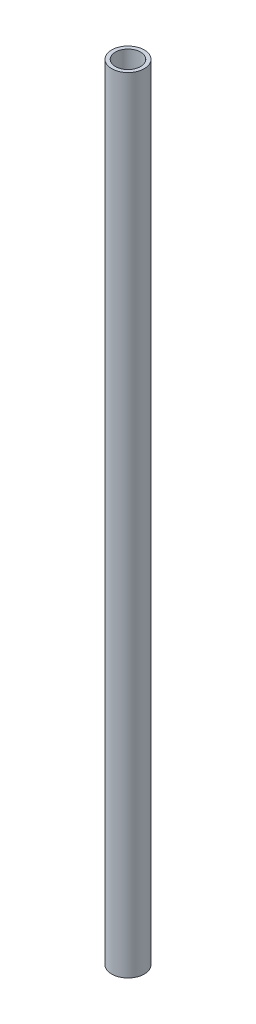
ISO-10303-21;
HEADER;
FILE_DESCRIPTION(('STEP AP214'),'2;1');
FILE_NAME('part.step','',(''),(''),'','','');
FILE_SCHEMA(('AUTOMOTIVE_DESIGN { 1 0 10303 214 1 1 1 1 }'));
ENDSEC;
DATA;
#1=APPLICATION_CONTEXT('core data for automotive mechanical design processes');
#2=APPLICATION_PROTOCOL_DEFINITION('international standard','automotive_design',2000,#1);
#3=PRODUCT_CONTEXT('',#1,'mechanical');
#4=PRODUCT('Part','Part','',(#3));
#5=PRODUCT_RELATED_PRODUCT_CATEGORY('part','',(#4));
#6=PRODUCT_DEFINITION_FORMATION('','',#4);
#7=PRODUCT_DEFINITION_CONTEXT('part definition',#1,'design');
#8=PRODUCT_DEFINITION('design','',#6,#7);
#9=PRODUCT_DEFINITION_SHAPE('','',#8);
#10=(LENGTH_UNIT() NAMED_UNIT(*) SI_UNIT(.MILLI.,.METRE.));
#11=(NAMED_UNIT(*) PLANE_ANGLE_UNIT() SI_UNIT($,.RADIAN.));
#12=(NAMED_UNIT(*) SI_UNIT($,.STERADIAN.) SOLID_ANGLE_UNIT());
#13=UNCERTAINTY_MEASURE_WITH_UNIT(LENGTH_MEASURE(1.E-05),#10,'distance_accuracy_value','');
#14=(GEOMETRIC_REPRESENTATION_CONTEXT(3) GLOBAL_UNCERTAINTY_ASSIGNED_CONTEXT((#13)) GLOBAL_UNIT_ASSIGNED_CONTEXT((#10,
#11,#12)) REPRESENTATION_CONTEXT('',''));
#15=CARTESIAN_POINT('',(0.,0.,0.));
#16=DIRECTION('',(0.,0.,1.));
#17=DIRECTION('',(1.,0.,0.));
#18=AXIS2_PLACEMENT_3D('',#15,#16,#17);
#19=CARTESIAN_POINT('',(0.,286.5,0.));
#20=DIRECTION('',(0.,1.,0.));
#21=DIRECTION('',(0.,0.,1.));
#22=AXIS2_PLACEMENT_3D('',#19,#20,#21);
#23=PLANE('',#22);
#24=CARTESIAN_POINT('',(0.,286.5,0.));
#25=DIRECTION('',(0.,1.,0.));
#26=DIRECTION('',(0.,0.,1.));
#27=AXIS2_PLACEMENT_3D('',#24,#25,#26);
#28=CIRCLE('',#27,5.95);
#29=CARTESIAN_POINT('',(0.,286.5,5.95));
#30=VERTEX_POINT('',#29);
#31=EDGE_CURVE('E10',#30,#30,#28,.T.);
#32=ORIENTED_EDGE('',*,*,#31,.T.);
#33=EDGE_LOOP('',(#32));
#34=FACE_BOUND('',#33,.T.);
#35=CARTESIAN_POINT('',(0.,286.5,0.));
#36=DIRECTION('',(0.,1.,0.));
#37=DIRECTION('',(0.,0.,1.));
#38=AXIS2_PLACEMENT_3D('',#35,#36,#37);
#39=CIRCLE('',#38,4.6);
#40=CARTESIAN_POINT('',(0.,286.5,4.6));
#41=VERTEX_POINT('',#40);
#42=EDGE_CURVE('E45',#41,#41,#39,.T.);
#43=ORIENTED_EDGE('',*,*,#42,.F.);
#44=EDGE_LOOP('',(#43));
#45=FACE_BOUND('',#44,.T.);
#46=ADVANCED_FACE('F34',(#34,#45),#23,.T.);
#47=CARTESIAN_POINT('',(0.,0.,0.));
#48=DIRECTION('',(0.,1.,0.));
#49=DIRECTION('',(0.,0.,1.));
#50=AXIS2_PLACEMENT_3D('',#47,#48,#49);
#51=PLANE('',#50);
#52=CARTESIAN_POINT('',(0.,0.,0.));
#53=DIRECTION('',(0.,1.,0.));
#54=DIRECTION('',(0.,0.,1.));
#55=AXIS2_PLACEMENT_3D('',#52,#53,#54);
#56=CIRCLE('',#55,5.95);
#57=CARTESIAN_POINT('',(0.,0.,5.95));
#58=VERTEX_POINT('',#57);
#59=EDGE_CURVE('E38',#58,#58,#56,.T.);
#60=ORIENTED_EDGE('',*,*,#59,.F.);
#61=EDGE_LOOP('',(#60));
#62=FACE_BOUND('',#61,.T.);
#63=CARTESIAN_POINT('',(0.,0.,0.));
#64=DIRECTION('',(0.,1.,0.));
#65=DIRECTION('',(0.,0.,1.));
#66=AXIS2_PLACEMENT_3D('',#63,#64,#65);
#67=CIRCLE('',#66,4.6);
#68=CARTESIAN_POINT('',(0.,0.,4.6));
#69=VERTEX_POINT('',#68);
#70=EDGE_CURVE('E47',#69,#69,#67,.T.);
#71=ORIENTED_EDGE('',*,*,#70,.T.);
#72=EDGE_LOOP('',(#71));
#73=FACE_BOUND('',#72,.T.);
#74=ADVANCED_FACE('F57',(#62,#73),#51,.F.);
#75=CARTESIAN_POINT('',(0.,286.5,0.));
#76=DIRECTION('',(0.,-1.,0.));
#77=DIRECTION('',(0.,0.,-1.));
#78=AXIS2_PLACEMENT_3D('',#75,#76,#77);
#79=CYLINDRICAL_SURFACE('',#78,5.95);
#80=ORIENTED_EDGE('',*,*,#31,.F.);
#81=EDGE_LOOP('',(#80));
#82=FACE_BOUND('',#81,.T.);
#83=ORIENTED_EDGE('',*,*,#59,.T.);
#84=EDGE_LOOP('',(#83));
#85=FACE_BOUND('',#84,.T.);
#86=ADVANCED_FACE('F36',(#82,#85),#79,.T.);
#87=CARTESIAN_POINT('',(0.,286.5,0.));
#88=DIRECTION('',(0.,-1.,0.));
#89=DIRECTION('',(0.,0.,-1.));
#90=AXIS2_PLACEMENT_3D('',#87,#88,#89);
#91=CYLINDRICAL_SURFACE('',#90,4.6);
#92=ORIENTED_EDGE('',*,*,#42,.T.);
#93=EDGE_LOOP('',(#92));
#94=FACE_BOUND('',#93,.T.);
#95=ORIENTED_EDGE('',*,*,#70,.F.);
#96=EDGE_LOOP('',(#95));
#97=FACE_BOUND('',#96,.T.);
#98=ADVANCED_FACE('F53',(#94,#97),#91,.F.);
#99=CLOSED_SHELL('',(#46,#74,#86,#98));
#100=MANIFOLD_SOLID_BREP('B2',#99);
#101=ADVANCED_BREP_SHAPE_REPRESENTATION('',(#18,#100),#14);
#102=SHAPE_DEFINITION_REPRESENTATION(#9,#101);
ENDSEC;
END-ISO-10303-21;
